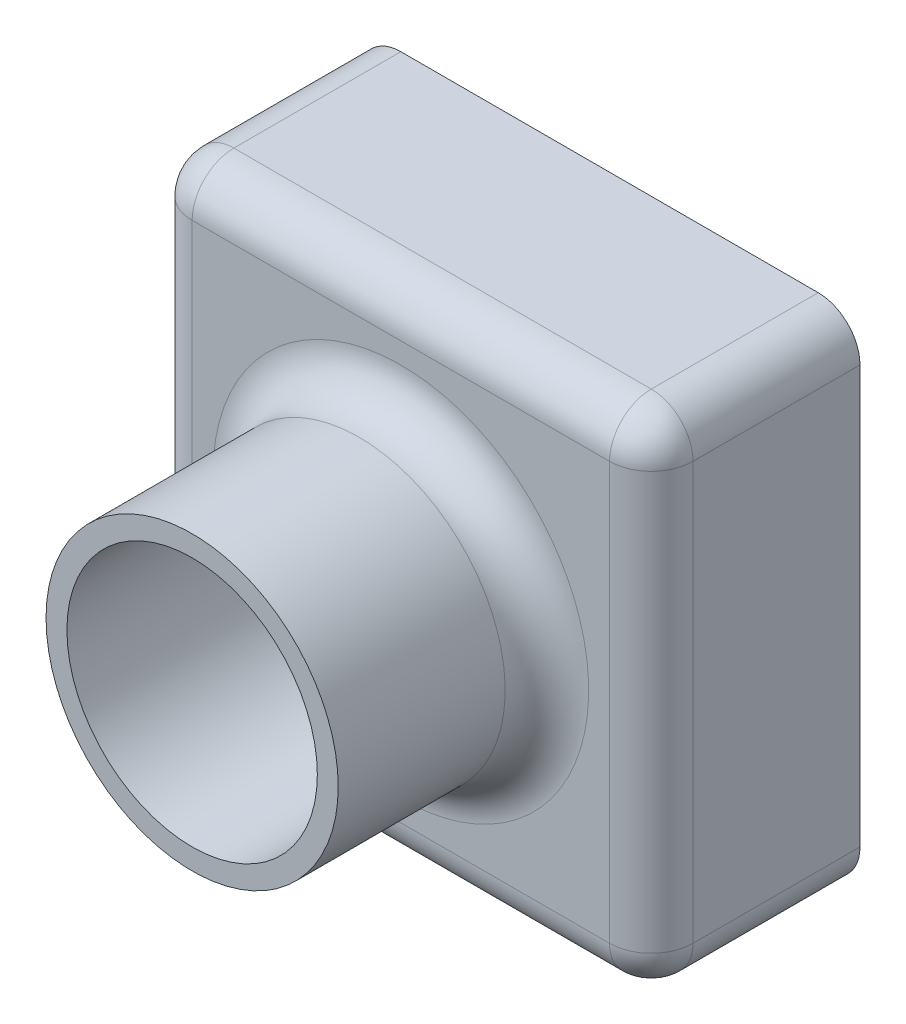
ISO-10303-21;
HEADER;
FILE_DESCRIPTION(('STEP AP214'),'2;1');
FILE_NAME('part.step','',(''),(''),'','','');
FILE_SCHEMA(('AUTOMOTIVE_DESIGN { 1 0 10303 214 1 1 1 1 }'));
ENDSEC;
DATA;
#1=APPLICATION_CONTEXT('core data for automotive mechanical design processes');
#2=APPLICATION_PROTOCOL_DEFINITION('international standard','automotive_design',2000,#1);
#3=PRODUCT_CONTEXT('',#1,'mechanical');
#4=PRODUCT('Part','Part','',(#3));
#5=PRODUCT_RELATED_PRODUCT_CATEGORY('part','',(#4));
#6=PRODUCT_DEFINITION_FORMATION('','',#4);
#7=PRODUCT_DEFINITION_CONTEXT('part definition',#1,'design');
#8=PRODUCT_DEFINITION('design','',#6,#7);
#9=PRODUCT_DEFINITION_SHAPE('','',#8);
#10=(LENGTH_UNIT() NAMED_UNIT(*) SI_UNIT(.MILLI.,.METRE.));
#11=(NAMED_UNIT(*) PLANE_ANGLE_UNIT() SI_UNIT($,.RADIAN.));
#12=(NAMED_UNIT(*) SI_UNIT($,.STERADIAN.) SOLID_ANGLE_UNIT());
#13=UNCERTAINTY_MEASURE_WITH_UNIT(LENGTH_MEASURE(1.E-05),#10,'distance_accuracy_value','');
#14=(GEOMETRIC_REPRESENTATION_CONTEXT(3) GLOBAL_UNCERTAINTY_ASSIGNED_CONTEXT((#13)) GLOBAL_UNIT_ASSIGNED_CONTEXT((#10,
#11,#12)) REPRESENTATION_CONTEXT('',''));
#15=CARTESIAN_POINT('',(0.,0.,0.));
#16=DIRECTION('',(0.,0.,1.));
#17=DIRECTION('',(1.,0.,0.));
#18=AXIS2_PLACEMENT_3D('',#15,#16,#17);
#19=CARTESIAN_POINT('',(0.,0.,0.));
#20=DIRECTION('',(0.,0.,-1.));
#21=DIRECTION('',(-1.,0.,0.));
#22=AXIS2_PLACEMENT_3D('',#19,#20,#21);
#23=PLANE('',#22);
#24=DIRECTION('',(0.,-1.,0.));
#25=VECTOR('',#24,1.);
#26=CARTESIAN_POINT('',(-60.,-60.,0.));
#27=LINE('',#26,#25);
#28=CARTESIAN_POINT('',(-60.,50.,0.));
#29=VERTEX_POINT('',#28);
#30=CARTESIAN_POINT('',(-60.,-50.,0.));
#31=VERTEX_POINT('',#30);
#32=EDGE_CURVE('E298',#29,#31,#27,.T.);
#33=ORIENTED_EDGE('',*,*,#32,.F.);
#34=CARTESIAN_POINT('',(-50.,50.,0.));
#35=DIRECTION('',(0.,0.,-1.));
#36=DIRECTION('',(-1.,0.,0.));
#37=AXIS2_PLACEMENT_3D('',#34,#35,#36);
#38=CIRCLE('',#37,10.);
#39=CARTESIAN_POINT('',(-50.,60.,0.));
#40=VERTEX_POINT('',#39);
#41=EDGE_CURVE('E70',#29,#40,#38,.T.);
#42=ORIENTED_EDGE('',*,*,#41,.T.);
#43=DIRECTION('',(-1.,0.,0.));
#44=VECTOR('',#43,1.);
#45=CARTESIAN_POINT('',(-60.,60.,0.));
#46=LINE('',#45,#44);
#47=CARTESIAN_POINT('',(50.,60.,0.));
#48=VERTEX_POINT('',#47);
#49=EDGE_CURVE('E295',#48,#40,#46,.T.);
#50=ORIENTED_EDGE('',*,*,#49,.F.);
#51=CARTESIAN_POINT('',(50.,50.,0.));
#52=DIRECTION('',(0.,0.,-1.));
#53=DIRECTION('',(-1.,0.,0.));
#54=AXIS2_PLACEMENT_3D('',#51,#52,#53);
#55=CIRCLE('',#54,10.);
#56=CARTESIAN_POINT('',(60.,50.,0.));
#57=VERTEX_POINT('',#56);
#58=EDGE_CURVE('E327',#48,#57,#55,.T.);
#59=ORIENTED_EDGE('',*,*,#58,.T.);
#60=DIRECTION('',(0.,1.,0.));
#61=VECTOR('',#60,1.);
#62=CARTESIAN_POINT('',(60.,-60.,0.));
#63=LINE('',#62,#61);
#64=CARTESIAN_POINT('',(60.,-50.,0.));
#65=VERTEX_POINT('',#64);
#66=EDGE_CURVE('E290',#65,#57,#63,.T.);
#67=ORIENTED_EDGE('',*,*,#66,.F.);
#68=CARTESIAN_POINT('',(50.,-50.,0.));
#69=DIRECTION('',(0.,0.,-1.));
#70=DIRECTION('',(-1.,0.,0.));
#71=AXIS2_PLACEMENT_3D('',#68,#69,#70);
#72=CIRCLE('',#71,10.);
#73=CARTESIAN_POINT('',(50.,-60.,0.));
#74=VERTEX_POINT('',#73);
#75=EDGE_CURVE('E324',#65,#74,#72,.T.);
#76=ORIENTED_EDGE('',*,*,#75,.T.);
#77=DIRECTION('',(1.,0.,0.));
#78=VECTOR('',#77,1.);
#79=CARTESIAN_POINT('',(-60.,-60.,0.));
#80=LINE('',#79,#78);
#81=CARTESIAN_POINT('',(-50.,-60.,0.));
#82=VERTEX_POINT('',#81);
#83=EDGE_CURVE('E301',#82,#74,#80,.T.);
#84=ORIENTED_EDGE('',*,*,#83,.F.);
#85=CARTESIAN_POINT('',(-50.,-50.,0.));
#86=DIRECTION('',(0.,0.,-1.));
#87=DIRECTION('',(-1.,0.,0.));
#88=AXIS2_PLACEMENT_3D('',#85,#86,#87);
#89=CIRCLE('',#88,10.);
#90=EDGE_CURVE('E320',#82,#31,#89,.T.);
#91=ORIENTED_EDGE('',*,*,#90,.T.);
#92=EDGE_LOOP('',(#33,#42,#50,#59,#67,#76,#84,#91));
#93=FACE_BOUND('',#92,.T.);
#94=CARTESIAN_POINT('',(-50.,50.,0.));
#95=DIRECTION('',(0.,0.,-1.));
#96=DIRECTION('',(-1.,0.,0.));
#97=AXIS2_PLACEMENT_3D('',#94,#95,#96);
#98=CIRCLE('',#97,5.);
#99=CARTESIAN_POINT('',(-55.,50.,0.));
#100=VERTEX_POINT('',#99);
#101=CARTESIAN_POINT('',(-50.,55.,0.));
#102=VERTEX_POINT('',#101);
#103=EDGE_CURVE('E259',#100,#102,#98,.T.);
#104=ORIENTED_EDGE('',*,*,#103,.F.);
#105=DIRECTION('',(0.,-1.,0.));
#106=VECTOR('',#105,1.);
#107=CARTESIAN_POINT('',(-55.,0.,0.));
#108=LINE('',#107,#106);
#109=CARTESIAN_POINT('',(-55.,-50.,0.));
#110=VERTEX_POINT('',#109);
#111=EDGE_CURVE('E253',#100,#110,#108,.T.);
#112=ORIENTED_EDGE('',*,*,#111,.T.);
#113=CARTESIAN_POINT('',(-50.,-50.,0.));
#114=DIRECTION('',(0.,0.,-1.));
#115=DIRECTION('',(-1.,0.,0.));
#116=AXIS2_PLACEMENT_3D('',#113,#114,#115);
#117=CIRCLE('',#116,5.);
#118=CARTESIAN_POINT('',(-50.,-55.,0.));
#119=VERTEX_POINT('',#118);
#120=EDGE_CURVE('E250',#119,#110,#117,.T.);
#121=ORIENTED_EDGE('',*,*,#120,.F.);
#122=DIRECTION('',(1.,0.,0.));
#123=VECTOR('',#122,1.);
#124=CARTESIAN_POINT('',(0.,-55.,0.));
#125=LINE('',#124,#123);
#126=CARTESIAN_POINT('',(50.,-55.,0.));
#127=VERTEX_POINT('',#126);
#128=EDGE_CURVE('E62',#119,#127,#125,.T.);
#129=ORIENTED_EDGE('',*,*,#128,.T.);
#130=CARTESIAN_POINT('',(50.,-50.,0.));
#131=DIRECTION('',(0.,0.,-1.));
#132=DIRECTION('',(-1.,0.,0.));
#133=AXIS2_PLACEMENT_3D('',#130,#131,#132);
#134=CIRCLE('',#133,5.);
#135=CARTESIAN_POINT('',(55.,-50.,0.));
#136=VERTEX_POINT('',#135);
#137=EDGE_CURVE('E247',#136,#127,#134,.T.);
#138=ORIENTED_EDGE('',*,*,#137,.F.);
#139=DIRECTION('',(0.,1.,0.));
#140=VECTOR('',#139,1.);
#141=CARTESIAN_POINT('',(55.,0.,0.));
#142=LINE('',#141,#140);
#143=CARTESIAN_POINT('',(55.,50.,0.));
#144=VERTEX_POINT('',#143);
#145=EDGE_CURVE('E242',#136,#144,#142,.T.);
#146=ORIENTED_EDGE('',*,*,#145,.T.);
#147=CARTESIAN_POINT('',(50.,50.,0.));
#148=DIRECTION('',(0.,0.,-1.));
#149=DIRECTION('',(-1.,0.,0.));
#150=AXIS2_PLACEMENT_3D('',#147,#148,#149);
#151=CIRCLE('',#150,5.);
#152=CARTESIAN_POINT('',(50.,55.,0.));
#153=VERTEX_POINT('',#152);
#154=EDGE_CURVE('E195',#153,#144,#151,.T.);
#155=ORIENTED_EDGE('',*,*,#154,.F.);
#156=DIRECTION('',(-1.,0.,0.));
#157=VECTOR('',#156,1.);
#158=CARTESIAN_POINT('',(0.,55.,0.));
#159=LINE('',#158,#157);
#160=EDGE_CURVE('E245',#153,#102,#159,.T.);
#161=ORIENTED_EDGE('',*,*,#160,.T.);
#162=EDGE_LOOP('',(#104,#112,#121,#129,#138,#146,#155,#161));
#163=FACE_BOUND('',#162,.T.);
#164=ADVANCED_FACE('F46',(#93,#163),#23,.T.);
#165=CARTESIAN_POINT('',(60.,-60.,50.));
#166=DIRECTION('',(-1.,0.,0.));
#167=DIRECTION('',(0.,0.,1.));
#168=AXIS2_PLACEMENT_3D('',#165,#166,#167);
#169=PLANE('',#168);
#170=ORIENTED_EDGE('',*,*,#66,.T.);
#171=DIRECTION('',(0.,0.,-1.));
#172=VECTOR('',#171,1.);
#173=CARTESIAN_POINT('',(60.,50.,50.));
#174=LINE('',#173,#172);
#175=CARTESIAN_POINT('',(60.,50.,40.));
#176=VERTEX_POINT('',#175);
#177=EDGE_CURVE('E333',#57,#176,#174,.F.);
#178=ORIENTED_EDGE('',*,*,#177,.T.);
#179=DIRECTION('',(0.,1.,0.));
#180=VECTOR('',#179,1.);
#181=CARTESIAN_POINT('',(60.,-60.,40.));
#182=LINE('',#181,#180);
#183=CARTESIAN_POINT('',(60.,-50.,40.));
#184=VERTEX_POINT('',#183);
#185=EDGE_CURVE('E309',#176,#184,#182,.F.);
#186=ORIENTED_EDGE('',*,*,#185,.T.);
#187=DIRECTION('',(0.,0.,-1.));
#188=VECTOR('',#187,1.);
#189=CARTESIAN_POINT('',(60.,-50.,50.));
#190=LINE('',#189,#188);
#191=EDGE_CURVE('E330',#184,#65,#190,.T.);
#192=ORIENTED_EDGE('',*,*,#191,.T.);
#193=EDGE_LOOP('',(#170,#178,#186,#192));
#194=FACE_BOUND('',#193,.T.);
#195=ADVANCED_FACE('F434',(#194),#169,.F.);
#196=CARTESIAN_POINT('',(-60.,60.,50.));
#197=DIRECTION('',(0.,-1.,0.));
#198=DIRECTION('',(0.,0.,-1.));
#199=AXIS2_PLACEMENT_3D('',#196,#197,#198);
#200=PLANE('',#199);
#201=ORIENTED_EDGE('',*,*,#49,.T.);
#202=DIRECTION('',(0.,0.,-1.));
#203=VECTOR('',#202,1.);
#204=CARTESIAN_POINT('',(-50.,60.,50.));
#205=LINE('',#204,#203);
#206=CARTESIAN_POINT('',(-50.,60.,40.));
#207=VERTEX_POINT('',#206);
#208=EDGE_CURVE('E407',#40,#207,#205,.F.);
#209=ORIENTED_EDGE('',*,*,#208,.T.);
#210=DIRECTION('',(-1.,0.,0.));
#211=VECTOR('',#210,1.);
#212=CARTESIAN_POINT('',(-60.,60.,40.));
#213=LINE('',#212,#211);
#214=CARTESIAN_POINT('',(50.,60.,40.));
#215=VERTEX_POINT('',#214);
#216=EDGE_CURVE('E313',#207,#215,#213,.F.);
#217=ORIENTED_EDGE('',*,*,#216,.T.);
#218=DIRECTION('',(0.,0.,-1.));
#219=VECTOR('',#218,1.);
#220=CARTESIAN_POINT('',(50.,60.,50.));
#221=LINE('',#220,#219);
#222=EDGE_CURVE('E316',#215,#48,#221,.T.);
#223=ORIENTED_EDGE('',*,*,#222,.T.);
#224=EDGE_LOOP('',(#201,#209,#217,#223));
#225=FACE_BOUND('',#224,.T.);
#226=ADVANCED_FACE('F440',(#225),#200,.F.);
#227=CARTESIAN_POINT('',(-60.,-60.,50.));
#228=DIRECTION('',(1.,0.,0.));
#229=DIRECTION('',(0.,0.,-1.));
#230=AXIS2_PLACEMENT_3D('',#227,#228,#229);
#231=PLANE('',#230);
#232=DIRECTION('',(0.,-1.,0.));
#233=VECTOR('',#232,1.);
#234=CARTESIAN_POINT('',(-60.,-60.,40.));
#235=LINE('',#234,#233);
#236=CARTESIAN_POINT('',(-60.,-50.,40.));
#237=VERTEX_POINT('',#236);
#238=CARTESIAN_POINT('',(-60.,50.,40.));
#239=VERTEX_POINT('',#238);
#240=EDGE_CURVE('E351',#237,#239,#235,.F.);
#241=ORIENTED_EDGE('',*,*,#240,.T.);
#242=DIRECTION('',(0.,0.,-1.));
#243=VECTOR('',#242,1.);
#244=CARTESIAN_POINT('',(-60.,50.,50.));
#245=LINE('',#244,#243);
#246=EDGE_CURVE('E402',#239,#29,#245,.T.);
#247=ORIENTED_EDGE('',*,*,#246,.T.);
#248=ORIENTED_EDGE('',*,*,#32,.T.);
#249=DIRECTION('',(0.,0.,-1.));
#250=VECTOR('',#249,1.);
#251=CARTESIAN_POINT('',(-60.,-50.,50.));
#252=LINE('',#251,#250);
#253=EDGE_CURVE('E355',#31,#237,#252,.F.);
#254=ORIENTED_EDGE('',*,*,#253,.T.);
#255=EDGE_LOOP('',(#241,#247,#248,#254));
#256=FACE_BOUND('',#255,.T.);
#257=ADVANCED_FACE('F895',(#256),#231,.F.);
#258=CARTESIAN_POINT('',(-60.,-60.,50.));
#259=DIRECTION('',(0.,1.,0.));
#260=DIRECTION('',(0.,0.,1.));
#261=AXIS2_PLACEMENT_3D('',#258,#259,#260);
#262=PLANE('',#261);
#263=ORIENTED_EDGE('',*,*,#83,.T.);
#264=DIRECTION('',(0.,0.,-1.));
#265=VECTOR('',#264,1.);
#266=CARTESIAN_POINT('',(50.,-60.,50.));
#267=LINE('',#266,#265);
#268=CARTESIAN_POINT('',(50.,-60.,40.));
#269=VERTEX_POINT('',#268);
#270=EDGE_CURVE('E348',#74,#269,#267,.F.);
#271=ORIENTED_EDGE('',*,*,#270,.T.);
#272=DIRECTION('',(1.,0.,0.));
#273=VECTOR('',#272,1.);
#274=CARTESIAN_POINT('',(-60.,-60.,40.));
#275=LINE('',#274,#273);
#276=CARTESIAN_POINT('',(-50.,-60.,40.));
#277=VERTEX_POINT('',#276);
#278=EDGE_CURVE('E342',#269,#277,#275,.F.);
#279=ORIENTED_EDGE('',*,*,#278,.T.);
#280=DIRECTION('',(0.,0.,-1.));
#281=VECTOR('',#280,1.);
#282=CARTESIAN_POINT('',(-50.,-60.,50.));
#283=LINE('',#282,#281);
#284=EDGE_CURVE('E345',#277,#82,#283,.T.);
#285=ORIENTED_EDGE('',*,*,#284,.T.);
#286=EDGE_LOOP('',(#263,#271,#279,#285));
#287=FACE_BOUND('',#286,.T.);
#288=ADVANCED_FACE('F455',(#287),#262,.F.);
#289=CARTESIAN_POINT('',(0.,0.,50.));
#290=DIRECTION('',(0.,0.,-1.));
#291=DIRECTION('',(-1.,0.,0.));
#292=AXIS2_PLACEMENT_3D('',#289,#290,#291);
#293=PLANE('',#292);
#294=CARTESIAN_POINT('',(0.,0.,50.));
#295=DIRECTION('',(0.,0.,-1.));
#296=DIRECTION('',(-1.,0.,0.));
#297=AXIS2_PLACEMENT_3D('',#294,#295,#296);
#298=CIRCLE('',#297,45.);
#299=CARTESIAN_POINT('',(-45.,0.,50.));
#300=VERTEX_POINT('',#299);
#301=EDGE_CURVE('E11',#300,#300,#298,.T.);
#302=ORIENTED_EDGE('',*,*,#301,.T.);
#303=EDGE_LOOP('',(#302));
#304=FACE_BOUND('',#303,.T.);
#305=DIRECTION('',(0.,1.,0.));
#306=VECTOR('',#305,1.);
#307=CARTESIAN_POINT('',(50.,0.,50.));
#308=LINE('',#307,#306);
#309=CARTESIAN_POINT('',(50.,-50.,50.));
#310=VERTEX_POINT('',#309);
#311=CARTESIAN_POINT('',(50.,50.,50.));
#312=VERTEX_POINT('',#311);
#313=EDGE_CURVE('E305',#310,#312,#308,.T.);
#314=ORIENTED_EDGE('',*,*,#313,.T.);
#315=DIRECTION('',(-1.,0.,0.));
#316=VECTOR('',#315,1.);
#317=CARTESIAN_POINT('',(0.,50.,50.));
#318=LINE('',#317,#316);
#319=CARTESIAN_POINT('',(-50.,50.,50.));
#320=VERTEX_POINT('',#319);
#321=EDGE_CURVE('E364',#312,#320,#318,.T.);
#322=ORIENTED_EDGE('',*,*,#321,.T.);
#323=DIRECTION('',(0.,-1.,0.));
#324=VECTOR('',#323,1.);
#325=CARTESIAN_POINT('',(-50.,0.,50.));
#326=LINE('',#325,#324);
#327=CARTESIAN_POINT('',(-50.,-50.,50.));
#328=VERTEX_POINT('',#327);
#329=EDGE_CURVE('E361',#320,#328,#326,.T.);
#330=ORIENTED_EDGE('',*,*,#329,.T.);
#331=DIRECTION('',(1.,0.,0.));
#332=VECTOR('',#331,1.);
#333=CARTESIAN_POINT('',(0.,-50.,50.));
#334=LINE('',#333,#332);
#335=EDGE_CURVE('E358',#328,#310,#334,.T.);
#336=ORIENTED_EDGE('',*,*,#335,.T.);
#337=EDGE_LOOP('',(#314,#322,#330,#336));
#338=FACE_BOUND('',#337,.T.);
#339=ADVANCED_FACE('F447',(#304,#338),#293,.F.);
#340=CARTESIAN_POINT('',(0.,0.,0.));
#341=DIRECTION('',(0.,0.,-1.));
#342=DIRECTION('',(-1.,0.,0.));
#343=AXIS2_PLACEMENT_3D('',#340,#341,#342);
#344=CIRCLE('',#343,35.);
#345=CARTESIAN_POINT('',(-35.,0.,0.));
#346=VERTEX_POINT('',#345);
#347=EDGE_CURVE('E236',#346,#346,#344,.F.);
#348=ORIENTED_EDGE('',*,*,#347,.F.);
#349=EDGE_LOOP('',(#348));
#350=FACE_BOUND('',#349,.T.);
#351=CARTESIAN_POINT('',(0.,0.,0.));
#352=DIRECTION('',(0.,0.,1.));
#353=DIRECTION('',(1.,0.,0.));
#354=AXIS2_PLACEMENT_3D('',#351,#352,#353);
#355=CIRCLE('',#354,30.);
#356=CARTESIAN_POINT('',(30.,0.,0.));
#357=VERTEX_POINT('',#356);
#358=EDGE_CURVE('E278',#357,#357,#355,.T.);
#359=ORIENTED_EDGE('',*,*,#358,.T.);
#360=EDGE_LOOP('',(#359));
#361=FACE_BOUND('',#360,.T.);
#362=ADVANCED_FACE('F436',(#350,#361),#23,.T.);
#363=CARTESIAN_POINT('',(0.,0.,100.));
#364=DIRECTION('',(0.,0.,-1.));
#365=DIRECTION('',(-1.,0.,0.));
#366=AXIS2_PLACEMENT_3D('',#363,#364,#365);
#367=CYLINDRICAL_SURFACE('',#366,35.);
#368=CARTESIAN_POINT('',(0.,0.,60.));
#369=DIRECTION('',(0.,0.,-1.));
#370=DIRECTION('',(-1.,0.,0.));
#371=AXIS2_PLACEMENT_3D('',#368,#369,#370);
#372=CIRCLE('',#371,35.);
#373=CARTESIAN_POINT('',(-35.,0.,60.));
#374=VERTEX_POINT('',#373);
#375=EDGE_CURVE('E55',#374,#374,#372,.F.);
#376=ORIENTED_EDGE('',*,*,#375,.T.);
#377=EDGE_LOOP('',(#376));
#378=FACE_BOUND('',#377,.T.);
#379=CARTESIAN_POINT('',(0.,0.,100.));
#380=DIRECTION('',(0.,0.,1.));
#381=DIRECTION('',(1.,0.,0.));
#382=AXIS2_PLACEMENT_3D('',#379,#380,#381);
#383=CIRCLE('',#382,35.);
#384=CARTESIAN_POINT('',(35.,0.,100.));
#385=VERTEX_POINT('',#384);
#386=EDGE_CURVE('E286',#385,#385,#383,.T.);
#387=ORIENTED_EDGE('',*,*,#386,.F.);
#388=EDGE_LOOP('',(#387));
#389=FACE_BOUND('',#388,.T.);
#390=ADVANCED_FACE('F416',(#378,#389),#367,.T.);
#391=CARTESIAN_POINT('',(0.,0.,100.));
#392=DIRECTION('',(0.,0.,1.));
#393=DIRECTION('',(1.,0.,0.));
#394=AXIS2_PLACEMENT_3D('',#391,#392,#393);
#395=PLANE('',#394);
#396=CARTESIAN_POINT('',(0.,0.,100.));
#397=DIRECTION('',(0.,0.,1.));
#398=DIRECTION('',(1.,0.,0.));
#399=AXIS2_PLACEMENT_3D('',#396,#397,#398);
#400=CIRCLE('',#399,30.);
#401=CARTESIAN_POINT('',(30.,0.,100.));
#402=VERTEX_POINT('',#401);
#403=EDGE_CURVE('E276',#402,#402,#400,.T.);
#404=ORIENTED_EDGE('',*,*,#403,.F.);
#405=EDGE_LOOP('',(#404));
#406=FACE_BOUND('',#405,.T.);
#407=ORIENTED_EDGE('',*,*,#386,.T.);
#408=EDGE_LOOP('',(#407));
#409=FACE_BOUND('',#408,.T.);
#410=ADVANCED_FACE('F453',(#406,#409),#395,.T.);
#411=CARTESIAN_POINT('',(50.,0.,40.));
#412=DIRECTION('',(0.,1.,0.));
#413=DIRECTION('',(0.,0.,1.));
#414=AXIS2_PLACEMENT_3D('',#411,#412,#413);
#415=CYLINDRICAL_SURFACE('',#414,10.);
#416=ORIENTED_EDGE('',*,*,#185,.F.);
#417=CARTESIAN_POINT('',(50.,50.,40.));
#418=DIRECTION('',(0.,1.,0.));
#419=DIRECTION('',(0.,0.,1.));
#420=AXIS2_PLACEMENT_3D('',#417,#418,#419);
#421=CIRCLE('',#420,10.);
#422=EDGE_CURVE('E339',#176,#312,#421,.F.);
#423=ORIENTED_EDGE('',*,*,#422,.T.);
#424=ORIENTED_EDGE('',*,*,#313,.F.);
#425=CARTESIAN_POINT('',(50.,-50.,40.));
#426=DIRECTION('',(0.,1.,0.));
#427=DIRECTION('',(0.,0.,1.));
#428=AXIS2_PLACEMENT_3D('',#425,#426,#427);
#429=CIRCLE('',#428,10.);
#430=EDGE_CURVE('E336',#310,#184,#429,.T.);
#431=ORIENTED_EDGE('',*,*,#430,.T.);
#432=EDGE_LOOP('',(#416,#423,#424,#431));
#433=FACE_BOUND('',#432,.T.);
#434=ADVANCED_FACE('F465',(#433),#415,.T.);
#435=CARTESIAN_POINT('',(50.,-50.,50.));
#436=DIRECTION('',(0.,0.,-1.));
#437=DIRECTION('',(-1.,0.,0.));
#438=AXIS2_PLACEMENT_3D('',#435,#436,#437);
#439=CYLINDRICAL_SURFACE('',#438,10.);
#440=ORIENTED_EDGE('',*,*,#75,.F.);
#441=ORIENTED_EDGE('',*,*,#191,.F.);
#442=CARTESIAN_POINT('',(50.,-50.,40.));
#443=DIRECTION('',(0.,0.,1.));
#444=DIRECTION('',(1.,0.,0.));
#445=AXIS2_PLACEMENT_3D('',#442,#443,#444);
#446=CIRCLE('',#445,10.);
#447=EDGE_CURVE('E291',#269,#184,#446,.T.);
#448=ORIENTED_EDGE('',*,*,#447,.F.);
#449=ORIENTED_EDGE('',*,*,#270,.F.);
#450=EDGE_LOOP('',(#440,#441,#448,#449));
#451=FACE_BOUND('',#450,.T.);
#452=ADVANCED_FACE('F471',(#451),#439,.T.);
#453=CARTESIAN_POINT('',(50.,-50.,40.));
#454=DIRECTION('',(0.,1.,0.));
#455=DIRECTION('',(0.,0.,1.));
#456=AXIS2_PLACEMENT_3D('',#453,#454,#455);
#457=SPHERICAL_SURFACE('',#456,10.);
#458=ORIENTED_EDGE('',*,*,#447,.T.);
#459=ORIENTED_EDGE('',*,*,#430,.F.);
#460=CARTESIAN_POINT('',(50.,-50.,40.));
#461=DIRECTION('',(-1.,0.,0.));
#462=DIRECTION('',(0.,0.,1.));
#463=AXIS2_PLACEMENT_3D('',#460,#461,#462);
#464=CIRCLE('',#463,10.);
#465=EDGE_CURVE('E389',#269,#310,#464,.T.);
#466=ORIENTED_EDGE('',*,*,#465,.F.);
#467=EDGE_LOOP('',(#458,#459,#466));
#468=FACE_BOUND('',#467,.T.);
#469=ADVANCED_FACE('F826',(#468),#457,.T.);
#470=CARTESIAN_POINT('',(0.,-50.,40.));
#471=DIRECTION('',(1.,0.,0.));
#472=DIRECTION('',(0.,0.,-1.));
#473=AXIS2_PLACEMENT_3D('',#470,#471,#472);
#474=CYLINDRICAL_SURFACE('',#473,10.);
#475=ORIENTED_EDGE('',*,*,#465,.T.);
#476=ORIENTED_EDGE('',*,*,#335,.F.);
#477=CARTESIAN_POINT('',(-50.,-50.,40.));
#478=DIRECTION('',(-1.,0.,0.));
#479=DIRECTION('',(0.,0.,1.));
#480=AXIS2_PLACEMENT_3D('',#477,#478,#479);
#481=CIRCLE('',#480,10.);
#482=EDGE_CURVE('E385',#277,#328,#481,.T.);
#483=ORIENTED_EDGE('',*,*,#482,.F.);
#484=ORIENTED_EDGE('',*,*,#278,.F.);
#485=EDGE_LOOP('',(#475,#476,#483,#484));
#486=FACE_BOUND('',#485,.T.);
#487=ADVANCED_FACE('F814',(#486),#474,.T.);
#488=CARTESIAN_POINT('',(-50.,-50.,50.));
#489=DIRECTION('',(0.,0.,-1.));
#490=DIRECTION('',(-1.,0.,0.));
#491=AXIS2_PLACEMENT_3D('',#488,#489,#490);
#492=CYLINDRICAL_SURFACE('',#491,10.);
#493=ORIENTED_EDGE('',*,*,#90,.F.);
#494=ORIENTED_EDGE('',*,*,#284,.F.);
#495=CARTESIAN_POINT('',(-50.,-50.,40.));
#496=DIRECTION('',(0.,0.,1.));
#497=DIRECTION('',(1.,0.,0.));
#498=AXIS2_PLACEMENT_3D('',#495,#496,#497);
#499=CIRCLE('',#498,10.);
#500=EDGE_CURVE('E381',#237,#277,#499,.T.);
#501=ORIENTED_EDGE('',*,*,#500,.F.);
#502=ORIENTED_EDGE('',*,*,#253,.F.);
#503=EDGE_LOOP('',(#493,#494,#501,#502));
#504=FACE_BOUND('',#503,.T.);
#505=ADVANCED_FACE('F803',(#504),#492,.T.);
#506=CARTESIAN_POINT('',(-50.,-50.,40.));
#507=DIRECTION('',(0.,-1.,0.));
#508=DIRECTION('',(0.,0.,-1.));
#509=AXIS2_PLACEMENT_3D('',#506,#507,#508);
#510=SPHERICAL_SURFACE('',#509,10.);
#511=ORIENTED_EDGE('',*,*,#500,.T.);
#512=ORIENTED_EDGE('',*,*,#482,.T.);
#513=CARTESIAN_POINT('',(-50.,-50.,40.));
#514=DIRECTION('',(0.,-1.,0.));
#515=DIRECTION('',(0.,0.,-1.));
#516=AXIS2_PLACEMENT_3D('',#513,#514,#515);
#517=CIRCLE('',#516,10.);
#518=EDGE_CURVE('E377',#237,#328,#517,.F.);
#519=ORIENTED_EDGE('',*,*,#518,.F.);
#520=EDGE_LOOP('',(#511,#512,#519));
#521=FACE_BOUND('',#520,.T.);
#522=ADVANCED_FACE('F791',(#521),#510,.T.);
#523=CARTESIAN_POINT('',(-50.,0.,40.));
#524=DIRECTION('',(0.,-1.,0.));
#525=DIRECTION('',(0.,0.,-1.));
#526=AXIS2_PLACEMENT_3D('',#523,#524,#525);
#527=CYLINDRICAL_SURFACE('',#526,10.);
#528=ORIENTED_EDGE('',*,*,#329,.F.);
#529=CARTESIAN_POINT('',(-50.,50.,40.));
#530=DIRECTION('',(0.,-1.,0.));
#531=DIRECTION('',(0.,0.,-1.));
#532=AXIS2_PLACEMENT_3D('',#529,#530,#531);
#533=CIRCLE('',#532,10.);
#534=EDGE_CURVE('E399',#320,#239,#533,.T.);
#535=ORIENTED_EDGE('',*,*,#534,.T.);
#536=ORIENTED_EDGE('',*,*,#240,.F.);
#537=ORIENTED_EDGE('',*,*,#518,.T.);
#538=EDGE_LOOP('',(#528,#535,#536,#537));
#539=FACE_BOUND('',#538,.T.);
#540=ADVANCED_FACE('F780',(#539),#527,.T.);
#541=CARTESIAN_POINT('',(0.,50.,40.));
#542=DIRECTION('',(-1.,0.,0.));
#543=DIRECTION('',(0.,0.,1.));
#544=AXIS2_PLACEMENT_3D('',#541,#542,#543);
#545=CYLINDRICAL_SURFACE('',#544,10.);
#546=ORIENTED_EDGE('',*,*,#216,.F.);
#547=CARTESIAN_POINT('',(-50.,50.,40.));
#548=DIRECTION('',(-1.,0.,0.));
#549=DIRECTION('',(0.,0.,1.));
#550=AXIS2_PLACEMENT_3D('',#547,#548,#549);
#551=CIRCLE('',#550,10.);
#552=EDGE_CURVE('E368',#207,#320,#551,.F.);
#553=ORIENTED_EDGE('',*,*,#552,.T.);
#554=ORIENTED_EDGE('',*,*,#321,.F.);
#555=CARTESIAN_POINT('',(50.,50.,40.));
#556=DIRECTION('',(1.,0.,0.));
#557=DIRECTION('',(0.,0.,-1.));
#558=AXIS2_PLACEMENT_3D('',#555,#556,#557);
#559=CIRCLE('',#558,10.);
#560=EDGE_CURVE('E373',#215,#312,#559,.T.);
#561=ORIENTED_EDGE('',*,*,#560,.F.);
#562=EDGE_LOOP('',(#546,#553,#554,#561));
#563=FACE_BOUND('',#562,.T.);
#564=ADVANCED_FACE('F766',(#563),#545,.T.);
#565=CARTESIAN_POINT('',(50.,50.,40.));
#566=DIRECTION('',(0.,-1.,0.));
#567=DIRECTION('',(0.,0.,-1.));
#568=AXIS2_PLACEMENT_3D('',#565,#566,#567);
#569=SPHERICAL_SURFACE('',#568,10.);
#570=ORIENTED_EDGE('',*,*,#560,.T.);
#571=ORIENTED_EDGE('',*,*,#422,.F.);
#572=CARTESIAN_POINT('',(50.,50.,40.));
#573=DIRECTION('',(0.,0.,-1.));
#574=DIRECTION('',(-1.,0.,0.));
#575=AXIS2_PLACEMENT_3D('',#572,#573,#574);
#576=CIRCLE('',#575,10.);
#577=EDGE_CURVE('E369',#215,#176,#576,.T.);
#578=ORIENTED_EDGE('',*,*,#577,.F.);
#579=EDGE_LOOP('',(#570,#571,#578));
#580=FACE_BOUND('',#579,.T.);
#581=ADVANCED_FACE('F753',(#580),#569,.T.);
#582=CARTESIAN_POINT('',(50.,50.,50.));
#583=DIRECTION('',(0.,0.,-1.));
#584=DIRECTION('',(-1.,0.,0.));
#585=AXIS2_PLACEMENT_3D('',#582,#583,#584);
#586=CYLINDRICAL_SURFACE('',#585,10.);
#587=ORIENTED_EDGE('',*,*,#577,.T.);
#588=ORIENTED_EDGE('',*,*,#177,.F.);
#589=ORIENTED_EDGE('',*,*,#58,.F.);
#590=ORIENTED_EDGE('',*,*,#222,.F.);
#591=EDGE_LOOP('',(#587,#588,#589,#590));
#592=FACE_BOUND('',#591,.T.);
#593=ADVANCED_FACE('F741',(#592),#586,.T.);
#594=CARTESIAN_POINT('',(-50.,50.,50.));
#595=DIRECTION('',(0.,0.,-1.));
#596=DIRECTION('',(-1.,0.,0.));
#597=AXIS2_PLACEMENT_3D('',#594,#595,#596);
#598=CYLINDRICAL_SURFACE('',#597,10.);
#599=ORIENTED_EDGE('',*,*,#41,.F.);
#600=ORIENTED_EDGE('',*,*,#246,.F.);
#601=CARTESIAN_POINT('',(-50.,50.,40.));
#602=DIRECTION('',(0.,0.,1.));
#603=DIRECTION('',(1.,0.,0.));
#604=AXIS2_PLACEMENT_3D('',#601,#602,#603);
#605=CIRCLE('',#604,10.);
#606=EDGE_CURVE('E282',#207,#239,#605,.T.);
#607=ORIENTED_EDGE('',*,*,#606,.F.);
#608=ORIENTED_EDGE('',*,*,#208,.F.);
#609=EDGE_LOOP('',(#599,#600,#607,#608));
#610=FACE_BOUND('',#609,.T.);
#611=ADVANCED_FACE('F728',(#610),#598,.T.);
#612=CARTESIAN_POINT('',(-50.,50.,40.));
#613=DIRECTION('',(0.,0.,1.));
#614=DIRECTION('',(1.,0.,0.));
#615=AXIS2_PLACEMENT_3D('',#612,#613,#614);
#616=SPHERICAL_SURFACE('',#615,10.);
#617=ORIENTED_EDGE('',*,*,#606,.T.);
#618=ORIENTED_EDGE('',*,*,#534,.F.);
#619=ORIENTED_EDGE('',*,*,#552,.F.);
#620=EDGE_LOOP('',(#617,#618,#619));
#621=FACE_BOUND('',#620,.T.);
#622=ADVANCED_FACE('F429',(#621),#616,.T.);
#623=CARTESIAN_POINT('',(0.,0.,0.));
#624=DIRECTION('',(0.,0.,1.));
#625=DIRECTION('',(1.,0.,0.));
#626=AXIS2_PLACEMENT_3D('',#623,#624,#625);
#627=CYLINDRICAL_SURFACE('',#626,30.);
#628=ORIENTED_EDGE('',*,*,#358,.F.);
#629=EDGE_LOOP('',(#628));
#630=FACE_BOUND('',#629,.T.);
#631=ORIENTED_EDGE('',*,*,#403,.T.);
#632=EDGE_LOOP('',(#631));
#633=FACE_BOUND('',#632,.T.);
#634=ADVANCED_FACE('F421',(#630,#633),#627,.F.);
#635=CARTESIAN_POINT('',(0.,0.,60.));
#636=DIRECTION('',(0.,0.,-1.));
#637=DIRECTION('',(-1.,0.,0.));
#638=AXIS2_PLACEMENT_3D('',#635,#636,#637);
#639=TOROIDAL_SURFACE('',#638,45.,10.);
#640=ORIENTED_EDGE('',*,*,#301,.F.);
#641=EDGE_LOOP('',(#640));
#642=FACE_BOUND('',#641,.T.);
#643=ORIENTED_EDGE('',*,*,#375,.F.);
#644=EDGE_LOOP('',(#643));
#645=FACE_BOUND('',#644,.T.);
#646=ADVANCED_FACE('F48',(#642,#645),#639,.F.);
#647=CARTESIAN_POINT('',(0.,0.,0.));
#648=DIRECTION('',(0.,0.,1.));
#649=DIRECTION('',(1.,0.,0.));
#650=AXIS2_PLACEMENT_3D('',#647,#648,#649);
#651=CYLINDRICAL_SURFACE('',#650,35.);
#652=ORIENTED_EDGE('',*,*,#347,.T.);
#653=EDGE_LOOP('',(#652));
#654=FACE_BOUND('',#653,.T.);
#655=CARTESIAN_POINT('',(0.,0.,48.8196601125011));
#656=DIRECTION('',(0.,0.,1.));
#657=DIRECTION('',(1.,0.,0.));
#658=AXIS2_PLACEMENT_3D('',#655,#656,#657);
#659=CIRCLE('',#658,35.);
#660=CARTESIAN_POINT('',(35.,0.,48.8196601125011));
#661=VERTEX_POINT('',#660);
#662=EDGE_CURVE('E272',#661,#661,#659,.T.);
#663=ORIENTED_EDGE('',*,*,#662,.F.);
#664=EDGE_LOOP('',(#663));
#665=FACE_BOUND('',#664,.T.);
#666=ADVANCED_FACE('F420',(#654,#665),#651,.T.);
#667=CARTESIAN_POINT('',(55.,-60.,50.));
#668=DIRECTION('',(-1.,0.,0.));
#669=DIRECTION('',(0.,0.,1.));
#670=AXIS2_PLACEMENT_3D('',#667,#668,#669);
#671=PLANE('',#670);
#672=ORIENTED_EDGE('',*,*,#145,.F.);
#673=DIRECTION('',(0.,0.,1.));
#674=VECTOR('',#673,1.);
#675=CARTESIAN_POINT('',(55.,-50.,50.));
#676=LINE('',#675,#674);
#677=CARTESIAN_POINT('',(55.,-50.,40.));
#678=VERTEX_POINT('',#677);
#679=EDGE_CURVE('E201',#678,#136,#676,.F.);
#680=ORIENTED_EDGE('',*,*,#679,.F.);
#681=DIRECTION('',(0.,1.,0.));
#682=VECTOR('',#681,1.);
#683=CARTESIAN_POINT('',(55.,-60.,40.));
#684=LINE('',#683,#682);
#685=CARTESIAN_POINT('',(55.,50.,40.));
#686=VERTEX_POINT('',#685);
#687=EDGE_CURVE('E205',#686,#678,#684,.F.);
#688=ORIENTED_EDGE('',*,*,#687,.F.);
#689=DIRECTION('',(0.,0.,1.));
#690=VECTOR('',#689,1.);
#691=CARTESIAN_POINT('',(55.,50.,50.));
#692=LINE('',#691,#690);
#693=EDGE_CURVE('E188',#144,#686,#692,.T.);
#694=ORIENTED_EDGE('',*,*,#693,.F.);
#695=EDGE_LOOP('',(#672,#680,#688,#694));
#696=FACE_BOUND('',#695,.T.);
#697=ADVANCED_FACE('F207',(#696),#671,.T.);
#698=CARTESIAN_POINT('',(-60.,55.,50.));
#699=DIRECTION('',(0.,-1.,0.));
#700=DIRECTION('',(0.,0.,-1.));
#701=AXIS2_PLACEMENT_3D('',#698,#699,#700);
#702=PLANE('',#701);
#703=ORIENTED_EDGE('',*,*,#160,.F.);
#704=DIRECTION('',(0.,0.,-1.));
#705=VECTOR('',#704,1.);
#706=CARTESIAN_POINT('',(50.,55.,50.));
#707=LINE('',#706,#705);
#708=CARTESIAN_POINT('',(50.,55.,40.));
#709=VERTEX_POINT('',#708);
#710=EDGE_CURVE('E239',#709,#153,#707,.T.);
#711=ORIENTED_EDGE('',*,*,#710,.F.);
#712=DIRECTION('',(1.,0.,0.));
#713=VECTOR('',#712,1.);
#714=CARTESIAN_POINT('',(-60.,55.,40.));
#715=LINE('',#714,#713);
#716=CARTESIAN_POINT('',(-50.,55.,40.));
#717=VERTEX_POINT('',#716);
#718=EDGE_CURVE('E212',#717,#709,#715,.T.);
#719=ORIENTED_EDGE('',*,*,#718,.F.);
#720=DIRECTION('',(0.,0.,-1.));
#721=VECTOR('',#720,1.);
#722=CARTESIAN_POINT('',(-50.,55.,50.));
#723=LINE('',#722,#721);
#724=EDGE_CURVE('E262',#102,#717,#723,.F.);
#725=ORIENTED_EDGE('',*,*,#724,.F.);
#726=EDGE_LOOP('',(#703,#711,#719,#725));
#727=FACE_BOUND('',#726,.T.);
#728=ADVANCED_FACE('F531',(#727),#702,.T.);
#729=CARTESIAN_POINT('',(-55.,-60.,50.));
#730=DIRECTION('',(1.,0.,0.));
#731=DIRECTION('',(0.,0.,-1.));
#732=AXIS2_PLACEMENT_3D('',#729,#730,#731);
#733=PLANE('',#732);
#734=DIRECTION('',(0.,1.,0.));
#735=VECTOR('',#734,1.);
#736=CARTESIAN_POINT('',(-55.,-60.,40.));
#737=LINE('',#736,#735);
#738=CARTESIAN_POINT('',(-55.,-50.,40.));
#739=VERTEX_POINT('',#738);
#740=CARTESIAN_POINT('',(-55.,50.,40.));
#741=VERTEX_POINT('',#740);
#742=EDGE_CURVE('E1045',#739,#741,#737,.T.);
#743=ORIENTED_EDGE('',*,*,#742,.F.);
#744=DIRECTION('',(0.,0.,-1.));
#745=VECTOR('',#744,1.);
#746=CARTESIAN_POINT('',(-55.,-50.,50.));
#747=LINE('',#746,#745);
#748=EDGE_CURVE('E1051',#110,#739,#747,.F.);
#749=ORIENTED_EDGE('',*,*,#748,.F.);
#750=ORIENTED_EDGE('',*,*,#111,.F.);
#751=DIRECTION('',(0.,0.,-1.));
#752=VECTOR('',#751,1.);
#753=CARTESIAN_POINT('',(-55.,50.,50.));
#754=LINE('',#753,#752);
#755=EDGE_CURVE('E263',#741,#100,#754,.T.);
#756=ORIENTED_EDGE('',*,*,#755,.F.);
#757=EDGE_LOOP('',(#743,#749,#750,#756));
#758=FACE_BOUND('',#757,.T.);
#759=ADVANCED_FACE('F528',(#758),#733,.T.);
#760=CARTESIAN_POINT('',(-60.,-55.,50.));
#761=DIRECTION('',(0.,1.,0.));
#762=DIRECTION('',(0.,0.,1.));
#763=AXIS2_PLACEMENT_3D('',#760,#761,#762);
#764=PLANE('',#763);
#765=ORIENTED_EDGE('',*,*,#128,.F.);
#766=DIRECTION('',(0.,0.,1.));
#767=VECTOR('',#766,1.);
#768=CARTESIAN_POINT('',(-50.,-55.,50.));
#769=LINE('',#768,#767);
#770=CARTESIAN_POINT('',(-50.,-55.,40.));
#771=VERTEX_POINT('',#770);
#772=EDGE_CURVE('E1046',#771,#119,#769,.F.);
#773=ORIENTED_EDGE('',*,*,#772,.F.);
#774=DIRECTION('',(1.,0.,0.));
#775=VECTOR('',#774,1.);
#776=CARTESIAN_POINT('',(-60.,-55.,40.));
#777=LINE('',#776,#775);
#778=CARTESIAN_POINT('',(50.,-55.,40.));
#779=VERTEX_POINT('',#778);
#780=EDGE_CURVE('E223',#779,#771,#777,.F.);
#781=ORIENTED_EDGE('',*,*,#780,.F.);
#782=DIRECTION('',(0.,0.,1.));
#783=VECTOR('',#782,1.);
#784=CARTESIAN_POINT('',(50.,-55.,50.));
#785=LINE('',#784,#783);
#786=EDGE_CURVE('E1041',#127,#779,#785,.T.);
#787=ORIENTED_EDGE('',*,*,#786,.F.);
#788=EDGE_LOOP('',(#765,#773,#781,#787));
#789=FACE_BOUND('',#788,.T.);
#790=ADVANCED_FACE('F524',(#789),#764,.T.);
#791=CARTESIAN_POINT('',(0.,0.,45.));
#792=DIRECTION('',(0.,0.,-1.));
#793=DIRECTION('',(-1.,0.,0.));
#794=AXIS2_PLACEMENT_3D('',#791,#792,#793);
#795=PLANE('',#794);
#796=CARTESIAN_POINT('',(0.,0.,45.));
#797=DIRECTION('',(0.,0.,-1.));
#798=DIRECTION('',(-1.,0.,0.));
#799=AXIS2_PLACEMENT_3D('',#796,#797,#798);
#800=CIRCLE('',#799,45.);
#801=CARTESIAN_POINT('',(-45.,0.,45.));
#802=VERTEX_POINT('',#801);
#803=EDGE_CURVE('E277',#802,#802,#800,.T.);
#804=ORIENTED_EDGE('',*,*,#803,.F.);
#805=EDGE_LOOP('',(#804));
#806=FACE_BOUND('',#805,.T.);
#807=DIRECTION('',(0.,1.,0.));
#808=VECTOR('',#807,1.);
#809=CARTESIAN_POINT('',(50.,0.,45.));
#810=LINE('',#809,#808);
#811=CARTESIAN_POINT('',(50.,-50.,45.));
#812=VERTEX_POINT('',#811);
#813=CARTESIAN_POINT('',(50.,50.,45.));
#814=VERTEX_POINT('',#813);
#815=EDGE_CURVE('E213',#812,#814,#810,.T.);
#816=ORIENTED_EDGE('',*,*,#815,.F.);
#817=DIRECTION('',(-1.,0.,0.));
#818=VECTOR('',#817,1.);
#819=CARTESIAN_POINT('',(0.,-50.,45.));
#820=LINE('',#819,#818);
#821=CARTESIAN_POINT('',(-50.,-50.,45.));
#822=VERTEX_POINT('',#821);
#823=EDGE_CURVE('E1069',#822,#812,#820,.F.);
#824=ORIENTED_EDGE('',*,*,#823,.F.);
#825=DIRECTION('',(0.,1.,0.));
#826=VECTOR('',#825,1.);
#827=CARTESIAN_POINT('',(-50.,0.,45.));
#828=LINE('',#827,#826);
#829=CARTESIAN_POINT('',(-50.,50.,45.));
#830=VERTEX_POINT('',#829);
#831=EDGE_CURVE('E1097',#830,#822,#828,.F.);
#832=ORIENTED_EDGE('',*,*,#831,.F.);
#833=DIRECTION('',(-1.,0.,0.));
#834=VECTOR('',#833,1.);
#835=CARTESIAN_POINT('',(0.,50.,45.));
#836=LINE('',#835,#834);
#837=EDGE_CURVE('E1084',#814,#830,#836,.T.);
#838=ORIENTED_EDGE('',*,*,#837,.F.);
#839=EDGE_LOOP('',(#816,#824,#832,#838));
#840=FACE_BOUND('',#839,.T.);
#841=ADVANCED_FACE('F521',(#806,#840),#795,.T.);
#842=CARTESIAN_POINT('',(50.,0.,40.));
#843=DIRECTION('',(0.,1.,0.));
#844=DIRECTION('',(0.,0.,1.));
#845=AXIS2_PLACEMENT_3D('',#842,#843,#844);
#846=CYLINDRICAL_SURFACE('',#845,5.);
#847=ORIENTED_EDGE('',*,*,#687,.T.);
#848=CARTESIAN_POINT('',(50.,-50.,40.));
#849=DIRECTION('',(0.,1.,0.));
#850=DIRECTION('',(0.,0.,1.));
#851=AXIS2_PLACEMENT_3D('',#848,#849,#850);
#852=CIRCLE('',#851,5.);
#853=EDGE_CURVE('E200',#812,#678,#852,.T.);
#854=ORIENTED_EDGE('',*,*,#853,.F.);
#855=ORIENTED_EDGE('',*,*,#815,.T.);
#856=CARTESIAN_POINT('',(50.,50.,40.));
#857=DIRECTION('',(0.,1.,0.));
#858=DIRECTION('',(0.,0.,1.));
#859=AXIS2_PLACEMENT_3D('',#856,#857,#858);
#860=CIRCLE('',#859,5.);
#861=EDGE_CURVE('E216',#686,#814,#860,.F.);
#862=ORIENTED_EDGE('',*,*,#861,.F.);
#863=EDGE_LOOP('',(#847,#854,#855,#862));
#864=FACE_BOUND('',#863,.T.);
#865=ADVANCED_FACE('F217',(#864),#846,.F.);
#866=CARTESIAN_POINT('',(50.,-50.,50.));
#867=DIRECTION('',(0.,0.,-1.));
#868=DIRECTION('',(-1.,0.,0.));
#869=AXIS2_PLACEMENT_3D('',#866,#867,#868);
#870=CYLINDRICAL_SURFACE('',#869,5.);
#871=ORIENTED_EDGE('',*,*,#137,.T.);
#872=ORIENTED_EDGE('',*,*,#786,.T.);
#873=CARTESIAN_POINT('',(50.,-50.,40.));
#874=DIRECTION('',(0.,0.,1.));
#875=DIRECTION('',(1.,0.,0.));
#876=AXIS2_PLACEMENT_3D('',#873,#874,#875);
#877=CIRCLE('',#876,5.);
#878=EDGE_CURVE('E246',#779,#678,#877,.T.);
#879=ORIENTED_EDGE('',*,*,#878,.T.);
#880=ORIENTED_EDGE('',*,*,#679,.T.);
#881=EDGE_LOOP('',(#871,#872,#879,#880));
#882=FACE_BOUND('',#881,.T.);
#883=ADVANCED_FACE('F514',(#882),#870,.F.);
#884=CARTESIAN_POINT('',(50.,-50.,40.));
#885=DIRECTION('',(0.,1.,0.));
#886=DIRECTION('',(0.,0.,1.));
#887=AXIS2_PLACEMENT_3D('',#884,#885,#886);
#888=SPHERICAL_SURFACE('',#887,5.);
#889=ORIENTED_EDGE('',*,*,#878,.F.);
#890=CARTESIAN_POINT('',(50.,-50.,40.));
#891=DIRECTION('',(1.,0.,0.));
#892=DIRECTION('',(0.,0.,-1.));
#893=AXIS2_PLACEMENT_3D('',#890,#891,#892);
#894=CIRCLE('',#893,5.);
#895=EDGE_CURVE('E1056',#779,#812,#894,.F.);
#896=ORIENTED_EDGE('',*,*,#895,.T.);
#897=ORIENTED_EDGE('',*,*,#853,.T.);
#898=EDGE_LOOP('',(#889,#896,#897));
#899=FACE_BOUND('',#898,.T.);
#900=ADVANCED_FACE('F510',(#899),#888,.F.);
#901=CARTESIAN_POINT('',(0.,-50.,40.));
#902=DIRECTION('',(1.,0.,0.));
#903=DIRECTION('',(0.,0.,-1.));
#904=AXIS2_PLACEMENT_3D('',#901,#902,#903);
#905=CYLINDRICAL_SURFACE('',#904,5.);
#906=ORIENTED_EDGE('',*,*,#895,.F.);
#907=ORIENTED_EDGE('',*,*,#780,.T.);
#908=CARTESIAN_POINT('',(-50.,-50.,40.));
#909=DIRECTION('',(1.,0.,0.));
#910=DIRECTION('',(0.,0.,-1.));
#911=AXIS2_PLACEMENT_3D('',#908,#909,#910);
#912=CIRCLE('',#911,5.);
#913=EDGE_CURVE('E1060',#771,#822,#912,.F.);
#914=ORIENTED_EDGE('',*,*,#913,.T.);
#915=ORIENTED_EDGE('',*,*,#823,.T.);
#916=EDGE_LOOP('',(#906,#907,#914,#915));
#917=FACE_BOUND('',#916,.T.);
#918=ADVANCED_FACE('F506',(#917),#905,.F.);
#919=CARTESIAN_POINT('',(-50.,-50.,50.));
#920=DIRECTION('',(0.,0.,-1.));
#921=DIRECTION('',(-1.,0.,0.));
#922=AXIS2_PLACEMENT_3D('',#919,#920,#921);
#923=CYLINDRICAL_SURFACE('',#922,5.);
#924=ORIENTED_EDGE('',*,*,#120,.T.);
#925=ORIENTED_EDGE('',*,*,#748,.T.);
#926=CARTESIAN_POINT('',(-50.,-50.,40.));
#927=DIRECTION('',(0.,0.,1.));
#928=DIRECTION('',(1.,0.,0.));
#929=AXIS2_PLACEMENT_3D('',#926,#927,#928);
#930=CIRCLE('',#929,5.);
#931=EDGE_CURVE('E1064',#739,#771,#930,.T.);
#932=ORIENTED_EDGE('',*,*,#931,.T.);
#933=ORIENTED_EDGE('',*,*,#772,.T.);
#934=EDGE_LOOP('',(#924,#925,#932,#933));
#935=FACE_BOUND('',#934,.T.);
#936=ADVANCED_FACE('F502',(#935),#923,.F.);
#937=CARTESIAN_POINT('',(-50.,-50.,40.));
#938=DIRECTION('',(0.,-1.,0.));
#939=DIRECTION('',(0.,0.,-1.));
#940=AXIS2_PLACEMENT_3D('',#937,#938,#939);
#941=SPHERICAL_SURFACE('',#940,5.);
#942=ORIENTED_EDGE('',*,*,#931,.F.);
#943=CARTESIAN_POINT('',(-50.,-50.,40.));
#944=DIRECTION('',(0.,-1.,0.));
#945=DIRECTION('',(0.,0.,-1.));
#946=AXIS2_PLACEMENT_3D('',#943,#944,#945);
#947=CIRCLE('',#946,5.);
#948=EDGE_CURVE('E233',#739,#822,#947,.F.);
#949=ORIENTED_EDGE('',*,*,#948,.T.);
#950=ORIENTED_EDGE('',*,*,#913,.F.);
#951=EDGE_LOOP('',(#942,#949,#950));
#952=FACE_BOUND('',#951,.T.);
#953=ADVANCED_FACE('F498',(#952),#941,.F.);
#954=CARTESIAN_POINT('',(-50.,0.,40.));
#955=DIRECTION('',(0.,-1.,0.));
#956=DIRECTION('',(0.,0.,-1.));
#957=AXIS2_PLACEMENT_3D('',#954,#955,#956);
#958=CYLINDRICAL_SURFACE('',#957,5.);
#959=ORIENTED_EDGE('',*,*,#831,.T.);
#960=ORIENTED_EDGE('',*,*,#948,.F.);
#961=ORIENTED_EDGE('',*,*,#742,.T.);
#962=CARTESIAN_POINT('',(-50.,50.,40.));
#963=DIRECTION('',(0.,-1.,0.));
#964=DIRECTION('',(0.,0.,-1.));
#965=AXIS2_PLACEMENT_3D('',#962,#963,#964);
#966=CIRCLE('',#965,5.);
#967=EDGE_CURVE('E1073',#830,#741,#966,.T.);
#968=ORIENTED_EDGE('',*,*,#967,.F.);
#969=EDGE_LOOP('',(#959,#960,#961,#968));
#970=FACE_BOUND('',#969,.T.);
#971=ADVANCED_FACE('F494',(#970),#958,.F.);
#972=CARTESIAN_POINT('',(0.,50.,40.));
#973=DIRECTION('',(-1.,0.,0.));
#974=DIRECTION('',(0.,0.,1.));
#975=AXIS2_PLACEMENT_3D('',#972,#973,#974);
#976=CYLINDRICAL_SURFACE('',#975,5.);
#977=ORIENTED_EDGE('',*,*,#718,.T.);
#978=CARTESIAN_POINT('',(50.,50.,40.));
#979=DIRECTION('',(1.,0.,0.));
#980=DIRECTION('',(0.,0.,-1.));
#981=AXIS2_PLACEMENT_3D('',#978,#979,#980);
#982=CIRCLE('',#981,5.);
#983=EDGE_CURVE('E227',#709,#814,#982,.T.);
#984=ORIENTED_EDGE('',*,*,#983,.T.);
#985=ORIENTED_EDGE('',*,*,#837,.T.);
#986=CARTESIAN_POINT('',(-50.,50.,40.));
#987=DIRECTION('',(-1.,0.,0.));
#988=DIRECTION('',(0.,0.,1.));
#989=AXIS2_PLACEMENT_3D('',#986,#987,#988);
#990=CIRCLE('',#989,5.);
#991=EDGE_CURVE('E1079',#717,#830,#990,.F.);
#992=ORIENTED_EDGE('',*,*,#991,.F.);
#993=EDGE_LOOP('',(#977,#984,#985,#992));
#994=FACE_BOUND('',#993,.T.);
#995=ADVANCED_FACE('F491',(#994),#976,.F.);
#996=CARTESIAN_POINT('',(50.,50.,40.));
#997=DIRECTION('',(0.,-1.,0.));
#998=DIRECTION('',(0.,0.,-1.));
#999=AXIS2_PLACEMENT_3D('',#996,#997,#998);
#1000=SPHERICAL_SURFACE('',#999,5.);
#1001=ORIENTED_EDGE('',*,*,#983,.F.);
#1002=CARTESIAN_POINT('',(50.,50.,40.));
#1003=DIRECTION('',(0.,0.,-1.));
#1004=DIRECTION('',(-1.,0.,0.));
#1005=AXIS2_PLACEMENT_3D('',#1002,#1003,#1004);
#1006=CIRCLE('',#1005,5.);
#1007=EDGE_CURVE('E192',#709,#686,#1006,.T.);
#1008=ORIENTED_EDGE('',*,*,#1007,.T.);
#1009=ORIENTED_EDGE('',*,*,#861,.T.);
#1010=EDGE_LOOP('',(#1001,#1008,#1009));
#1011=FACE_BOUND('',#1010,.T.);
#1012=ADVANCED_FACE('F225',(#1011),#1000,.F.);
#1013=CARTESIAN_POINT('',(50.,50.,50.));
#1014=DIRECTION('',(0.,0.,-1.));
#1015=DIRECTION('',(-1.,0.,0.));
#1016=AXIS2_PLACEMENT_3D('',#1013,#1014,#1015);
#1017=CYLINDRICAL_SURFACE('',#1016,5.);
#1018=ORIENTED_EDGE('',*,*,#1007,.F.);
#1019=ORIENTED_EDGE('',*,*,#710,.T.);
#1020=ORIENTED_EDGE('',*,*,#154,.T.);
#1021=ORIENTED_EDGE('',*,*,#693,.T.);
#1022=EDGE_LOOP('',(#1018,#1019,#1020,#1021));
#1023=FACE_BOUND('',#1022,.T.);
#1024=ADVANCED_FACE('F190',(#1023),#1017,.F.);
#1025=CARTESIAN_POINT('',(-50.,50.,50.));
#1026=DIRECTION('',(0.,0.,-1.));
#1027=DIRECTION('',(-1.,0.,0.));
#1028=AXIS2_PLACEMENT_3D('',#1025,#1026,#1027);
#1029=CYLINDRICAL_SURFACE('',#1028,5.);
#1030=ORIENTED_EDGE('',*,*,#103,.T.);
#1031=ORIENTED_EDGE('',*,*,#724,.T.);
#1032=CARTESIAN_POINT('',(-50.,50.,40.));
#1033=DIRECTION('',(0.,0.,1.));
#1034=DIRECTION('',(1.,0.,0.));
#1035=AXIS2_PLACEMENT_3D('',#1032,#1033,#1034);
#1036=CIRCLE('',#1035,5.);
#1037=EDGE_CURVE('E229',#717,#741,#1036,.T.);
#1038=ORIENTED_EDGE('',*,*,#1037,.T.);
#1039=ORIENTED_EDGE('',*,*,#755,.T.);
#1040=EDGE_LOOP('',(#1030,#1031,#1038,#1039));
#1041=FACE_BOUND('',#1040,.T.);
#1042=ADVANCED_FACE('F482',(#1041),#1029,.F.);
#1043=CARTESIAN_POINT('',(-50.,50.,40.));
#1044=DIRECTION('',(0.,0.,1.));
#1045=DIRECTION('',(1.,0.,0.));
#1046=AXIS2_PLACEMENT_3D('',#1043,#1044,#1045);
#1047=SPHERICAL_SURFACE('',#1046,5.);
#1048=ORIENTED_EDGE('',*,*,#1037,.F.);
#1049=ORIENTED_EDGE('',*,*,#991,.T.);
#1050=ORIENTED_EDGE('',*,*,#967,.T.);
#1051=EDGE_LOOP('',(#1048,#1049,#1050));
#1052=FACE_BOUND('',#1051,.T.);
#1053=ADVANCED_FACE('F477',(#1052),#1047,.F.);
#1054=CARTESIAN_POINT('',(0.,0.,60.));
#1055=DIRECTION('',(0.,0.,-1.));
#1056=DIRECTION('',(-1.,0.,0.));
#1057=AXIS2_PLACEMENT_3D('',#1054,#1055,#1056);
#1058=TOROIDAL_SURFACE('',#1057,45.,15.);
#1059=ORIENTED_EDGE('',*,*,#662,.T.);
#1060=EDGE_LOOP('',(#1059));
#1061=FACE_BOUND('',#1060,.T.);
#1062=ORIENTED_EDGE('',*,*,#803,.T.);
#1063=EDGE_LOOP('',(#1062));
#1064=FACE_BOUND('',#1063,.T.);
#1065=ADVANCED_FACE('F475',(#1061,#1064),#1058,.T.);
#1066=CLOSED_SHELL('',(#164,#195,#226,#257,#288,#339,#362,#390,#410,#434,#452,#469,#487,#505,
#522,#540,#564,#581,#593,#611,#622,#634,#646,#666,#697,#728,#759,#790,#841,#865,#883,#900,#918,
#936,#953,#971,#995,#1012,#1024,#1042,#1053,#1065));
#1067=MANIFOLD_SOLID_BREP('B2',#1066);
#1068=ADVANCED_BREP_SHAPE_REPRESENTATION('',(#18,#1067),#14);
#1069=SHAPE_DEFINITION_REPRESENTATION(#9,#1068);
ENDSEC;
END-ISO-10303-21;
